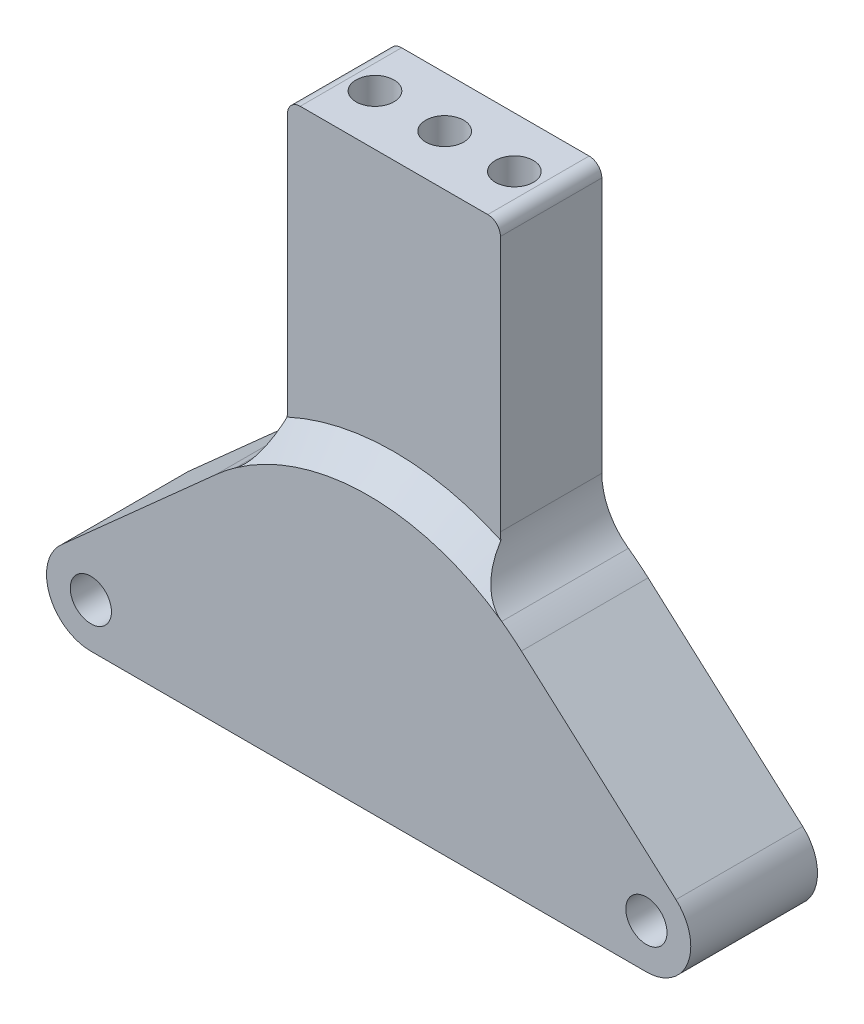
ISO-10303-21;
HEADER;
FILE_DESCRIPTION(('STEP AP214'),'2;1');
FILE_NAME('part.step','',(''),(''),'','','');
FILE_SCHEMA(('AUTOMOTIVE_DESIGN { 1 0 10303 214 1 1 1 1 }'));
ENDSEC;
DATA;
#1=APPLICATION_CONTEXT('core data for automotive mechanical design processes');
#2=APPLICATION_PROTOCOL_DEFINITION('international standard','automotive_design',2000,#1);
#3=PRODUCT_CONTEXT('',#1,'mechanical');
#4=PRODUCT('Part','Part','',(#3));
#5=PRODUCT_RELATED_PRODUCT_CATEGORY('part','',(#4));
#6=PRODUCT_DEFINITION_FORMATION('','',#4);
#7=PRODUCT_DEFINITION_CONTEXT('part definition',#1,'design');
#8=PRODUCT_DEFINITION('design','',#6,#7);
#9=PRODUCT_DEFINITION_SHAPE('','',#8);
#10=(LENGTH_UNIT() NAMED_UNIT(*) SI_UNIT(.MILLI.,.METRE.));
#11=(NAMED_UNIT(*) PLANE_ANGLE_UNIT() SI_UNIT($,.RADIAN.));
#12=(NAMED_UNIT(*) SI_UNIT($,.STERADIAN.) SOLID_ANGLE_UNIT());
#13=UNCERTAINTY_MEASURE_WITH_UNIT(LENGTH_MEASURE(1.E-05),#10,'distance_accuracy_value','');
#14=(GEOMETRIC_REPRESENTATION_CONTEXT(3) GLOBAL_UNCERTAINTY_ASSIGNED_CONTEXT((#13)) GLOBAL_UNIT_ASSIGNED_CONTEXT((#10,
#11,#12)) REPRESENTATION_CONTEXT('',''));
#15=CARTESIAN_POINT('',(0.,0.,0.));
#16=DIRECTION('',(0.,0.,1.));
#17=DIRECTION('',(1.,0.,0.));
#18=AXIS2_PLACEMENT_3D('',#15,#16,#17);
#19=CARTESIAN_POINT('',(0.,0.,10.));
#20=DIRECTION('',(0.,0.,-1.));
#21=DIRECTION('',(-1.,0.,0.));
#22=AXIS2_PLACEMENT_3D('',#19,#20,#21);
#23=CYLINDRICAL_SURFACE('',#22,18.1);
#24=CARTESIAN_POINT('',(0.,0.,10.));
#25=DIRECTION('',(0.,0.,1.));
#26=DIRECTION('',(1.,0.,0.));
#27=AXIS2_PLACEMENT_3D('',#24,#25,#26);
#28=CIRCLE('',#27,18.1);
#29=CARTESIAN_POINT('',(-10.4995670995671,14.7434422955322,10.));
#30=VERTEX_POINT('',#29);
#31=CARTESIAN_POINT('',(-12.0556569343066,13.5007827877611,10.));
#32=VERTEX_POINT('',#31);
#33=EDGE_CURVE('E146',#30,#32,#28,.T.);
#34=ORIENTED_EDGE('',*,*,#33,.F.);
#35=DIRECTION('',(0.,0.,-1.));
#36=VECTOR('',#35,1.);
#37=CARTESIAN_POINT('',(-10.4995670995671,14.7434422955322,10.));
#38=LINE('',#37,#36);
#39=CARTESIAN_POINT('',(-10.4995670995671,14.7434422955322,0.));
#40=VERTEX_POINT('',#39);
#41=EDGE_CURVE('E222',#30,#40,#38,.T.);
#42=ORIENTED_EDGE('',*,*,#41,.T.);
#43=CARTESIAN_POINT('',(0.,0.,0.));
#44=DIRECTION('',(0.,0.,1.));
#45=DIRECTION('',(1.,0.,0.));
#46=AXIS2_PLACEMENT_3D('',#43,#44,#45);
#47=CIRCLE('',#46,18.1);
#48=CARTESIAN_POINT('',(-12.0556569343066,13.5007827877611,0.));
#49=VERTEX_POINT('',#48);
#50=EDGE_CURVE('E163',#40,#49,#47,.T.);
#51=ORIENTED_EDGE('',*,*,#50,.T.);
#52=DIRECTION('',(0.,0.,-1.));
#53=VECTOR('',#52,1.);
#54=CARTESIAN_POINT('',(-12.0556569343066,13.5007827877611,10.));
#55=LINE('',#54,#53);
#56=EDGE_CURVE('E161',#32,#49,#55,.T.);
#57=ORIENTED_EDGE('',*,*,#56,.F.);
#58=EDGE_LOOP('',(#34,#42,#51,#57));
#59=FACE_BOUND('',#58,.T.);
#60=ADVANCED_FACE('F36',(#59),#23,.T.);
#61=DIRECTION('',(0.,0.,-1.));
#62=VECTOR('',#61,1.);
#63=CARTESIAN_POINT('',(10.4995670995671,14.7434422955322,10.));
#64=LINE('',#63,#62);
#65=CARTESIAN_POINT('',(10.4995670995671,14.7434422955322,0.));
#66=VERTEX_POINT('',#65);
#67=CARTESIAN_POINT('',(10.4995670995671,14.7434422955322,10.));
#68=VERTEX_POINT('',#67);
#69=EDGE_CURVE('E224',#66,#68,#64,.F.);
#70=ORIENTED_EDGE('',*,*,#69,.T.);
#71=CARTESIAN_POINT('',(12.0556569343066,13.5007827877611,10.));
#72=VERTEX_POINT('',#71);
#73=EDGE_CURVE('E159',#72,#68,#28,.T.);
#74=ORIENTED_EDGE('',*,*,#73,.F.);
#75=DIRECTION('',(0.,0.,-1.));
#76=VECTOR('',#75,1.);
#77=CARTESIAN_POINT('',(12.0556569343066,13.5007827877611,10.));
#78=LINE('',#77,#76);
#79=CARTESIAN_POINT('',(12.0556569343066,13.5007827877611,0.));
#80=VERTEX_POINT('',#79);
#81=EDGE_CURVE('E189',#72,#80,#78,.T.);
#82=ORIENTED_EDGE('',*,*,#81,.T.);
#83=EDGE_CURVE('E190',#80,#66,#47,.T.);
#84=ORIENTED_EDGE('',*,*,#83,.T.);
#85=EDGE_LOOP('',(#70,#74,#82,#84));
#86=FACE_BOUND('',#85,.T.);
#87=ADVANCED_FACE('F276',(#86),#23,.T.);
#88=CARTESIAN_POINT('',(-12.0556569343066,13.5007827877611,10.));
#89=DIRECTION('',(-0.666058394160585,0.745899601533761,0.));
#90=DIRECTION('',(-0.745899601533761,-0.666058394160585,0.));
#91=AXIS2_PLACEMENT_3D('',#88,#89,#90);
#92=PLANE('',#91);
#93=DIRECTION('',(0.745899601533761,0.666058394160585,0.));
#94=VECTOR('',#93,1.);
#95=CARTESIAN_POINT('',(-12.0556569343066,13.5007827877611,0.));
#96=LINE('',#95,#94);
#97=CARTESIAN_POINT('',(-24.251204379562,2.61064860536815,0.));
#98=VERTEX_POINT('',#97);
#99=EDGE_CURVE('E193',#98,#49,#96,.T.);
#100=ORIENTED_EDGE('',*,*,#99,.F.);
#101=DIRECTION('',(0.,0.,-1.));
#102=VECTOR('',#101,1.);
#103=CARTESIAN_POINT('',(-24.251204379562,2.61064860536815,10.));
#104=LINE('',#103,#102);
#105=CARTESIAN_POINT('',(-24.251204379562,2.61064860536815,10.));
#106=VERTEX_POINT('',#105);
#107=EDGE_CURVE('E168',#106,#98,#104,.T.);
#108=ORIENTED_EDGE('',*,*,#107,.F.);
#109=DIRECTION('',(0.745899601533761,0.666058394160585,0.));
#110=VECTOR('',#109,1.);
#111=CARTESIAN_POINT('',(-12.0556569343066,13.5007827877611,10.));
#112=LINE('',#111,#110);
#113=EDGE_CURVE('E152',#106,#32,#112,.T.);
#114=ORIENTED_EDGE('',*,*,#113,.T.);
#115=ORIENTED_EDGE('',*,*,#56,.T.);
#116=EDGE_LOOP('',(#100,#108,#114,#115));
#117=FACE_BOUND('',#116,.T.);
#118=ADVANCED_FACE('F170',(#117),#92,.T.);
#119=CARTESIAN_POINT('',(-21.92,0.,10.));
#120=DIRECTION('',(0.,0.,-1.));
#121=DIRECTION('',(-1.,0.,0.));
#122=AXIS2_PLACEMENT_3D('',#119,#120,#121);
#123=CYLINDRICAL_SURFACE('',#122,3.49999999999998);
#124=CARTESIAN_POINT('',(-21.92,0.,0.));
#125=DIRECTION('',(0.,0.,1.));
#126=DIRECTION('',(1.,0.,0.));
#127=AXIS2_PLACEMENT_3D('',#124,#125,#126);
#128=CIRCLE('',#127,3.49999999999998);
#129=CARTESIAN_POINT('',(-21.92,-3.49999999999998,0.));
#130=VERTEX_POINT('',#129);
#131=EDGE_CURVE('E195',#98,#130,#128,.T.);
#132=ORIENTED_EDGE('',*,*,#131,.T.);
#133=DIRECTION('',(0.,0.,-1.));
#134=VECTOR('',#133,1.);
#135=CARTESIAN_POINT('',(-21.92,-3.49999999999998,10.));
#136=LINE('',#135,#134);
#137=CARTESIAN_POINT('',(-21.92,-3.49999999999998,10.));
#138=VERTEX_POINT('',#137);
#139=EDGE_CURVE('E216',#138,#130,#136,.T.);
#140=ORIENTED_EDGE('',*,*,#139,.F.);
#141=CARTESIAN_POINT('',(-21.92,0.,10.));
#142=DIRECTION('',(0.,0.,1.));
#143=DIRECTION('',(1.,0.,0.));
#144=AXIS2_PLACEMENT_3D('',#141,#142,#143);
#145=CIRCLE('',#144,3.49999999999998);
#146=EDGE_CURVE('E172',#106,#138,#145,.T.);
#147=ORIENTED_EDGE('',*,*,#146,.F.);
#148=ORIENTED_EDGE('',*,*,#107,.T.);
#149=EDGE_LOOP('',(#132,#140,#147,#148));
#150=FACE_BOUND('',#149,.T.);
#151=ADVANCED_FACE('F411',(#150),#123,.T.);
#152=CARTESIAN_POINT('',(0.,-3.49999999999998,10.));
#153=DIRECTION('',(0.,1.,0.));
#154=DIRECTION('',(-1.,0.,0.));
#155=AXIS2_PLACEMENT_3D('',#152,#153,#154);
#156=PLANE('',#155);
#157=DIRECTION('',(1.,0.,0.));
#158=VECTOR('',#157,1.);
#159=CARTESIAN_POINT('',(0.,-3.49999999999998,0.));
#160=LINE('',#159,#158);
#161=CARTESIAN_POINT('',(21.92,-3.49999999999998,0.));
#162=VERTEX_POINT('',#161);
#163=EDGE_CURVE('E197',#130,#162,#160,.T.);
#164=ORIENTED_EDGE('',*,*,#163,.T.);
#165=DIRECTION('',(0.,0.,-1.));
#166=VECTOR('',#165,1.);
#167=CARTESIAN_POINT('',(21.92,-3.49999999999998,10.));
#168=LINE('',#167,#166);
#169=CARTESIAN_POINT('',(21.92,-3.49999999999998,10.));
#170=VERTEX_POINT('',#169);
#171=EDGE_CURVE('E213',#170,#162,#168,.T.);
#172=ORIENTED_EDGE('',*,*,#171,.F.);
#173=DIRECTION('',(1.,0.,0.));
#174=VECTOR('',#173,1.);
#175=CARTESIAN_POINT('',(0.,-3.49999999999998,10.));
#176=LINE('',#175,#174);
#177=EDGE_CURVE('E174',#138,#170,#176,.T.);
#178=ORIENTED_EDGE('',*,*,#177,.F.);
#179=ORIENTED_EDGE('',*,*,#139,.T.);
#180=EDGE_LOOP('',(#164,#172,#178,#179));
#181=FACE_BOUND('',#180,.T.);
#182=ADVANCED_FACE('F408',(#181),#156,.F.);
#183=CARTESIAN_POINT('',(21.92,0.,10.));
#184=DIRECTION('',(0.,0.,-1.));
#185=DIRECTION('',(-1.,0.,0.));
#186=AXIS2_PLACEMENT_3D('',#183,#184,#185);
#187=CYLINDRICAL_SURFACE('',#186,3.49999999999998);
#188=CARTESIAN_POINT('',(21.92,0.,0.));
#189=DIRECTION('',(0.,0.,1.));
#190=DIRECTION('',(1.,0.,0.));
#191=AXIS2_PLACEMENT_3D('',#188,#189,#190);
#192=CIRCLE('',#191,3.49999999999998);
#193=CARTESIAN_POINT('',(24.251204379562,2.61064860536815,0.));
#194=VERTEX_POINT('',#193);
#195=EDGE_CURVE('E199',#162,#194,#192,.T.);
#196=ORIENTED_EDGE('',*,*,#195,.T.);
#197=DIRECTION('',(0.,0.,-1.));
#198=VECTOR('',#197,1.);
#199=CARTESIAN_POINT('',(24.251204379562,2.61064860536815,10.));
#200=LINE('',#199,#198);
#201=CARTESIAN_POINT('',(24.251204379562,2.61064860536815,10.));
#202=VERTEX_POINT('',#201);
#203=EDGE_CURVE('E210',#202,#194,#200,.T.);
#204=ORIENTED_EDGE('',*,*,#203,.F.);
#205=CARTESIAN_POINT('',(21.92,0.,10.));
#206=DIRECTION('',(0.,0.,1.));
#207=DIRECTION('',(1.,0.,0.));
#208=AXIS2_PLACEMENT_3D('',#205,#206,#207);
#209=CIRCLE('',#208,3.49999999999998);
#210=EDGE_CURVE('E179',#170,#202,#209,.T.);
#211=ORIENTED_EDGE('',*,*,#210,.F.);
#212=ORIENTED_EDGE('',*,*,#171,.T.);
#213=EDGE_LOOP('',(#196,#204,#211,#212));
#214=FACE_BOUND('',#213,.T.);
#215=ADVANCED_FACE('F401',(#214),#187,.T.);
#216=CARTESIAN_POINT('',(21.92,0.,10.));
#217=DIRECTION('',(0.,0.,-1.));
#218=DIRECTION('',(-1.,0.,0.));
#219=AXIS2_PLACEMENT_3D('',#216,#217,#218);
#220=CYLINDRICAL_SURFACE('',#219,1.625);
#221=CARTESIAN_POINT('',(21.92,0.,10.));
#222=DIRECTION('',(0.,0.,1.));
#223=DIRECTION('',(1.,0.,0.));
#224=AXIS2_PLACEMENT_3D('',#221,#222,#223);
#225=CIRCLE('',#224,1.625);
#226=CARTESIAN_POINT('',(23.545,0.,10.));
#227=VERTEX_POINT('',#226);
#228=EDGE_CURVE('E183',#227,#227,#225,.T.);
#229=ORIENTED_EDGE('',*,*,#228,.T.);
#230=EDGE_LOOP('',(#229));
#231=FACE_BOUND('',#230,.T.);
#232=CARTESIAN_POINT('',(21.92,0.,0.));
#233=DIRECTION('',(0.,0.,1.));
#234=DIRECTION('',(1.,0.,0.));
#235=AXIS2_PLACEMENT_3D('',#232,#233,#234);
#236=CIRCLE('',#235,1.625);
#237=CARTESIAN_POINT('',(23.545,0.,0.));
#238=VERTEX_POINT('',#237);
#239=EDGE_CURVE('E203',#238,#238,#236,.T.);
#240=ORIENTED_EDGE('',*,*,#239,.F.);
#241=EDGE_LOOP('',(#240));
#242=FACE_BOUND('',#241,.T.);
#243=ADVANCED_FACE('F398',(#231,#242),#220,.F.);
#244=CARTESIAN_POINT('',(12.0556569343066,13.5007827877611,10.));
#245=DIRECTION('',(-0.666058394160585,-0.745899601533761,0.));
#246=DIRECTION('',(0.745899601533761,-0.666058394160585,0.));
#247=AXIS2_PLACEMENT_3D('',#244,#245,#246);
#248=PLANE('',#247);
#249=DIRECTION('',(-0.745899601533761,0.666058394160585,0.));
#250=VECTOR('',#249,1.);
#251=CARTESIAN_POINT('',(12.0556569343066,13.5007827877611,0.));
#252=LINE('',#251,#250);
#253=EDGE_CURVE('E201',#194,#80,#252,.T.);
#254=ORIENTED_EDGE('',*,*,#253,.T.);
#255=ORIENTED_EDGE('',*,*,#81,.F.);
#256=DIRECTION('',(-0.745899601533761,0.666058394160585,0.));
#257=VECTOR('',#256,1.);
#258=CARTESIAN_POINT('',(12.0556569343066,13.5007827877611,10.));
#259=LINE('',#258,#257);
#260=EDGE_CURVE('E181',#202,#72,#259,.T.);
#261=ORIENTED_EDGE('',*,*,#260,.F.);
#262=ORIENTED_EDGE('',*,*,#203,.T.);
#263=EDGE_LOOP('',(#254,#255,#261,#262));
#264=FACE_BOUND('',#263,.T.);
#265=ADVANCED_FACE('F396',(#264),#248,.F.);
#266=CARTESIAN_POINT('',(-21.92,0.,10.));
#267=DIRECTION('',(0.,0.,-1.));
#268=DIRECTION('',(-1.,0.,0.));
#269=AXIS2_PLACEMENT_3D('',#266,#267,#268);
#270=CYLINDRICAL_SURFACE('',#269,1.625);
#271=CARTESIAN_POINT('',(-21.92,0.,10.));
#272=DIRECTION('',(0.,0.,1.));
#273=DIRECTION('',(1.,0.,0.));
#274=AXIS2_PLACEMENT_3D('',#271,#272,#273);
#275=CIRCLE('',#274,1.625);
#276=CARTESIAN_POINT('',(-20.295,0.,10.));
#277=VERTEX_POINT('',#276);
#278=EDGE_CURVE('E186',#277,#277,#275,.F.);
#279=ORIENTED_EDGE('',*,*,#278,.F.);
#280=EDGE_LOOP('',(#279));
#281=FACE_BOUND('',#280,.T.);
#282=CARTESIAN_POINT('',(-21.92,0.,0.));
#283=DIRECTION('',(0.,0.,1.));
#284=DIRECTION('',(1.,0.,0.));
#285=AXIS2_PLACEMENT_3D('',#282,#283,#284);
#286=CIRCLE('',#285,1.625);
#287=CARTESIAN_POINT('',(-20.295,0.,0.));
#288=VERTEX_POINT('',#287);
#289=EDGE_CURVE('E157',#288,#288,#286,.F.);
#290=ORIENTED_EDGE('',*,*,#289,.T.);
#291=EDGE_LOOP('',(#290));
#292=FACE_BOUND('',#291,.T.);
#293=ADVANCED_FACE('F391',(#281,#292),#270,.F.);
#294=CARTESIAN_POINT('',(0.,0.,10.));
#295=DIRECTION('',(0.,0.,1.));
#296=DIRECTION('',(1.,0.,0.));
#297=AXIS2_PLACEMENT_3D('',#294,#295,#296);
#298=PLANE('',#297);
#299=ORIENTED_EDGE('',*,*,#73,.T.);
#300=EDGE_CURVE('E154',#68,#30,#28,.T.);
#301=ORIENTED_EDGE('',*,*,#300,.T.);
#302=ORIENTED_EDGE('',*,*,#33,.T.);
#303=ORIENTED_EDGE('',*,*,#113,.F.);
#304=ORIENTED_EDGE('',*,*,#146,.T.);
#305=ORIENTED_EDGE('',*,*,#177,.T.);
#306=ORIENTED_EDGE('',*,*,#210,.T.);
#307=ORIENTED_EDGE('',*,*,#260,.T.);
#308=EDGE_LOOP('',(#299,#301,#302,#303,#304,#305,#306,#307));
#309=FACE_BOUND('',#308,.T.);
#310=ORIENTED_EDGE('',*,*,#228,.F.);
#311=EDGE_LOOP('',(#310));
#312=FACE_BOUND('',#311,.T.);
#313=ORIENTED_EDGE('',*,*,#278,.T.);
#314=EDGE_LOOP('',(#313));
#315=FACE_BOUND('',#314,.T.);
#316=ADVANCED_FACE('F149',(#309,#312,#315),#298,.T.);
#317=CARTESIAN_POINT('',(0.,0.,0.));
#318=DIRECTION('',(0.,0.,1.));
#319=DIRECTION('',(1.,0.,0.));
#320=AXIS2_PLACEMENT_3D('',#317,#318,#319);
#321=PLANE('',#320);
#322=DIRECTION('',(1.,0.,0.));
#323=VECTOR('',#322,1.);
#324=CARTESIAN_POINT('',(0.,40.,0.));
#325=LINE('',#324,#323);
#326=CARTESIAN_POINT('',(-7.4,40.,0.));
#327=VERTEX_POINT('',#326);
#328=CARTESIAN_POINT('',(7.4,40.,0.));
#329=VERTEX_POINT('',#328);
#330=EDGE_CURVE('E331',#327,#329,#325,.T.);
#331=ORIENTED_EDGE('',*,*,#330,.T.);
#332=CARTESIAN_POINT('',(7.4,39.,0.));
#333=DIRECTION('',(0.,0.,1.));
#334=DIRECTION('',(1.,0.,0.));
#335=AXIS2_PLACEMENT_3D('',#332,#333,#334);
#336=CIRCLE('',#335,1.);
#337=CARTESIAN_POINT('',(8.4,39.,0.));
#338=VERTEX_POINT('',#337);
#339=EDGE_CURVE('E316',#329,#338,#336,.F.);
#340=ORIENTED_EDGE('',*,*,#339,.T.);
#341=DIRECTION('',(0.,-1.,0.));
#342=VECTOR('',#341,1.);
#343=CARTESIAN_POINT('',(8.40000000000001,0.,0.));
#344=LINE('',#343,#342);
#345=CARTESIAN_POINT('',(8.4,18.8162164103201,0.));
#346=VERTEX_POINT('',#345);
#347=EDGE_CURVE('E330',#338,#346,#344,.T.);
#348=ORIENTED_EDGE('',*,*,#347,.T.);
#349=CARTESIAN_POINT('',(13.4,18.8162164103201,0.));
#350=DIRECTION('',(0.,0.,1.));
#351=DIRECTION('',(1.,0.,0.));
#352=AXIS2_PLACEMENT_3D('',#349,#350,#351);
#353=CIRCLE('',#352,5.);
#354=EDGE_CURVE('E229',#346,#66,#353,.T.);
#355=ORIENTED_EDGE('',*,*,#354,.T.);
#356=ORIENTED_EDGE('',*,*,#83,.F.);
#357=ORIENTED_EDGE('',*,*,#253,.F.);
#358=ORIENTED_EDGE('',*,*,#195,.F.);
#359=ORIENTED_EDGE('',*,*,#163,.F.);
#360=ORIENTED_EDGE('',*,*,#131,.F.);
#361=ORIENTED_EDGE('',*,*,#99,.T.);
#362=ORIENTED_EDGE('',*,*,#50,.F.);
#363=CARTESIAN_POINT('',(-13.4,18.8162164103201,0.));
#364=DIRECTION('',(0.,0.,1.));
#365=DIRECTION('',(1.,0.,0.));
#366=AXIS2_PLACEMENT_3D('',#363,#364,#365);
#367=CIRCLE('',#366,5.);
#368=CARTESIAN_POINT('',(-8.4,18.8162164103201,0.));
#369=VERTEX_POINT('',#368);
#370=EDGE_CURVE('E234',#40,#369,#367,.T.);
#371=ORIENTED_EDGE('',*,*,#370,.T.);
#372=DIRECTION('',(0.,-1.,0.));
#373=VECTOR('',#372,1.);
#374=CARTESIAN_POINT('',(-8.4,0.,0.));
#375=LINE('',#374,#373);
#376=CARTESIAN_POINT('',(-8.4,39.,0.));
#377=VERTEX_POINT('',#376);
#378=EDGE_CURVE('E335',#377,#369,#375,.T.);
#379=ORIENTED_EDGE('',*,*,#378,.F.);
#380=CARTESIAN_POINT('',(-7.4,39.,0.));
#381=DIRECTION('',(0.,0.,1.));
#382=DIRECTION('',(1.,0.,0.));
#383=AXIS2_PLACEMENT_3D('',#380,#381,#382);
#384=CIRCLE('',#383,1.);
#385=EDGE_CURVE('E312',#377,#327,#384,.F.);
#386=ORIENTED_EDGE('',*,*,#385,.T.);
#387=EDGE_LOOP('',(#331,#340,#348,#355,#356,#357,#358,#359,#360,#361,#362,#371,#379,#386));
#388=FACE_BOUND('',#387,.T.);
#389=ORIENTED_EDGE('',*,*,#239,.T.);
#390=EDGE_LOOP('',(#389));
#391=FACE_BOUND('',#390,.T.);
#392=ORIENTED_EDGE('',*,*,#289,.F.);
#393=EDGE_LOOP('',(#392));
#394=FACE_BOUND('',#393,.T.);
#395=ADVANCED_FACE('F328',(#388,#391,#394),#321,.F.);
#396=CARTESIAN_POINT('',(8.40000000000001,0.,8.));
#397=DIRECTION('',(1.,0.,0.));
#398=DIRECTION('',(0.,1.,0.));
#399=AXIS2_PLACEMENT_3D('',#396,#397,#398);
#400=PLANE('',#399);
#401=ORIENTED_EDGE('',*,*,#347,.F.);
#402=DIRECTION('',(0.,0.,-1.));
#403=VECTOR('',#402,1.);
#404=CARTESIAN_POINT('',(8.4,39.,8.));
#405=LINE('',#404,#403);
#406=CARTESIAN_POINT('',(8.4,39.,8.));
#407=VERTEX_POINT('',#406);
#408=EDGE_CURVE('E59',#338,#407,#405,.F.);
#409=ORIENTED_EDGE('',*,*,#408,.T.);
#410=DIRECTION('',(0.,-1.,0.));
#411=VECTOR('',#410,1.);
#412=CARTESIAN_POINT('',(8.40000000000001,0.,8.));
#413=LINE('',#412,#411);
#414=CARTESIAN_POINT('',(8.4,18.8162164103201,8.));
#415=VERTEX_POINT('',#414);
#416=EDGE_CURVE('E321',#407,#415,#413,.T.);
#417=ORIENTED_EDGE('',*,*,#416,.T.);
#418=DIRECTION('',(0.,0.,-1.));
#419=VECTOR('',#418,1.);
#420=CARTESIAN_POINT('',(8.4,18.8162164103201,8.));
#421=LINE('',#420,#419);
#422=EDGE_CURVE('E167',#415,#346,#421,.T.);
#423=ORIENTED_EDGE('',*,*,#422,.T.);
#424=EDGE_LOOP('',(#401,#409,#417,#423));
#425=FACE_BOUND('',#424,.T.);
#426=ADVANCED_FACE('F332',(#425),#400,.T.);
#427=CARTESIAN_POINT('',(0.,40.,8.));
#428=DIRECTION('',(0.,1.,0.));
#429=DIRECTION('',(0.,0.,1.));
#430=AXIS2_PLACEMENT_3D('',#427,#428,#429);
#431=PLANE('',#430);
#432=CARTESIAN_POINT('',(-5.5,40.,4.));
#433=DIRECTION('',(0.,1.,0.));
#434=DIRECTION('',(0.,0.,1.));
#435=AXIS2_PLACEMENT_3D('',#432,#433,#434);
#436=CIRCLE('',#435,1.5);
#437=CARTESIAN_POINT('',(-5.5,40.,5.5));
#438=VERTEX_POINT('',#437);
#439=EDGE_CURVE('E338',#438,#438,#436,.T.);
#440=ORIENTED_EDGE('',*,*,#439,.F.);
#441=EDGE_LOOP('',(#440));
#442=FACE_BOUND('',#441,.T.);
#443=CARTESIAN_POINT('',(5.5,40.,4.));
#444=DIRECTION('',(0.,1.,0.));
#445=DIRECTION('',(0.,0.,1.));
#446=AXIS2_PLACEMENT_3D('',#443,#444,#445);
#447=CIRCLE('',#446,1.5);
#448=CARTESIAN_POINT('',(5.5,40.,5.5));
#449=VERTEX_POINT('',#448);
#450=EDGE_CURVE('E351',#449,#449,#447,.T.);
#451=ORIENTED_EDGE('',*,*,#450,.F.);
#452=EDGE_LOOP('',(#451));
#453=FACE_BOUND('',#452,.T.);
#454=CARTESIAN_POINT('',(0.,40.,4.));
#455=DIRECTION('',(0.,1.,0.));
#456=DIRECTION('',(0.,0.,1.));
#457=AXIS2_PLACEMENT_3D('',#454,#455,#456);
#458=CIRCLE('',#457,1.5);
#459=CARTESIAN_POINT('',(0.,40.,5.5));
#460=VERTEX_POINT('',#459);
#461=EDGE_CURVE('E345',#460,#460,#458,.T.);
#462=ORIENTED_EDGE('',*,*,#461,.F.);
#463=EDGE_LOOP('',(#462));
#464=FACE_BOUND('',#463,.T.);
#465=DIRECTION('',(1.,0.,0.));
#466=VECTOR('',#465,1.);
#467=CARTESIAN_POINT('',(0.,40.,8.));
#468=LINE('',#467,#466);
#469=CARTESIAN_POINT('',(-7.4,40.,8.));
#470=VERTEX_POINT('',#469);
#471=CARTESIAN_POINT('',(7.4,40.,8.));
#472=VERTEX_POINT('',#471);
#473=EDGE_CURVE('E320',#470,#472,#468,.T.);
#474=ORIENTED_EDGE('',*,*,#473,.T.);
#475=DIRECTION('',(0.,0.,-1.));
#476=VECTOR('',#475,1.);
#477=CARTESIAN_POINT('',(7.4,40.,8.));
#478=LINE('',#477,#476);
#479=EDGE_CURVE('E306',#472,#329,#478,.T.);
#480=ORIENTED_EDGE('',*,*,#479,.T.);
#481=ORIENTED_EDGE('',*,*,#330,.F.);
#482=DIRECTION('',(0.,0.,-1.));
#483=VECTOR('',#482,1.);
#484=CARTESIAN_POINT('',(-7.4,40.,8.));
#485=LINE('',#484,#483);
#486=EDGE_CURVE('E305',#327,#470,#485,.F.);
#487=ORIENTED_EDGE('',*,*,#486,.T.);
#488=EDGE_LOOP('',(#474,#480,#481,#487));
#489=FACE_BOUND('',#488,.T.);
#490=ADVANCED_FACE('F323',(#442,#453,#464,#489),#431,.T.);
#491=CARTESIAN_POINT('',(-8.4,0.,8.));
#492=DIRECTION('',(1.,0.,0.));
#493=DIRECTION('',(0.,1.,0.));
#494=AXIS2_PLACEMENT_3D('',#491,#492,#493);
#495=PLANE('',#494);
#496=DIRECTION('',(0.,-1.,0.));
#497=VECTOR('',#496,1.);
#498=CARTESIAN_POINT('',(-8.4,0.,8.));
#499=LINE('',#498,#497);
#500=CARTESIAN_POINT('',(-8.4,39.,8.));
#501=VERTEX_POINT('',#500);
#502=CARTESIAN_POINT('',(-8.4,18.8162164103201,8.));
#503=VERTEX_POINT('',#502);
#504=EDGE_CURVE('E325',#501,#503,#499,.T.);
#505=ORIENTED_EDGE('',*,*,#504,.F.);
#506=DIRECTION('',(0.,0.,-1.));
#507=VECTOR('',#506,1.);
#508=CARTESIAN_POINT('',(-8.4,39.,0.));
#509=LINE('',#508,#507);
#510=EDGE_CURVE('E11',#501,#377,#509,.T.);
#511=ORIENTED_EDGE('',*,*,#510,.T.);
#512=ORIENTED_EDGE('',*,*,#378,.T.);
#513=DIRECTION('',(0.,0.,1.));
#514=VECTOR('',#513,1.);
#515=CARTESIAN_POINT('',(-8.4,18.8162164103201,8.));
#516=LINE('',#515,#514);
#517=EDGE_CURVE('E226',#369,#503,#516,.T.);
#518=ORIENTED_EDGE('',*,*,#517,.T.);
#519=EDGE_LOOP('',(#505,#511,#512,#518));
#520=FACE_BOUND('',#519,.T.);
#521=ADVANCED_FACE('F363',(#520),#495,.F.);
#522=CARTESIAN_POINT('',(0.,0.,8.));
#523=DIRECTION('',(0.,0.,1.));
#524=DIRECTION('',(1.,0.,0.));
#525=AXIS2_PLACEMENT_3D('',#522,#523,#524);
#526=PLANE('',#525);
#527=ORIENTED_EDGE('',*,*,#416,.F.);
#528=CARTESIAN_POINT('',(7.4,39.,8.));
#529=DIRECTION('',(0.,0.,1.));
#530=DIRECTION('',(1.,0.,0.));
#531=AXIS2_PLACEMENT_3D('',#528,#529,#530);
#532=CIRCLE('',#531,1.);
#533=EDGE_CURVE('E44',#407,#472,#532,.T.);
#534=ORIENTED_EDGE('',*,*,#533,.T.);
#535=ORIENTED_EDGE('',*,*,#473,.F.);
#536=CARTESIAN_POINT('',(-7.4,39.,8.));
#537=DIRECTION('',(0.,0.,1.));
#538=DIRECTION('',(1.,0.,0.));
#539=AXIS2_PLACEMENT_3D('',#536,#537,#538);
#540=CIRCLE('',#539,1.);
#541=EDGE_CURVE('E51',#470,#501,#540,.T.);
#542=ORIENTED_EDGE('',*,*,#541,.T.);
#543=ORIENTED_EDGE('',*,*,#504,.T.);
#544=CARTESIAN_POINT('',(-13.4,18.8162164103201,8.));
#545=DIRECTION('',(0.,0.,1.));
#546=DIRECTION('',(1.,0.,0.));
#547=AXIS2_PLACEMENT_3D('',#544,#545,#546);
#548=CIRCLE('',#547,5.);
#549=CARTESIAN_POINT('',(-8.43267298154483,18.2455481251269,8.));
#550=VERTEX_POINT('',#549);
#551=EDGE_CURVE('E237',#503,#550,#548,.F.);
#552=ORIENTED_EDGE('',*,*,#551,.T.);
#553=CARTESIAN_POINT('',(0.,0.,8.));
#554=DIRECTION('',(0.,0.,1.));
#555=DIRECTION('',(1.,0.,0.));
#556=AXIS2_PLACEMENT_3D('',#553,#554,#555);
#557=CIRCLE('',#556,20.1);
#558=CARTESIAN_POINT('',(8.43267298154484,18.2455481251269,8.));
#559=VERTEX_POINT('',#558);
#560=EDGE_CURVE('E240',#550,#559,#557,.F.);
#561=ORIENTED_EDGE('',*,*,#560,.T.);
#562=CARTESIAN_POINT('',(13.4,18.8162164103201,8.));
#563=DIRECTION('',(0.,0.,1.));
#564=DIRECTION('',(1.,0.,0.));
#565=AXIS2_PLACEMENT_3D('',#562,#563,#564);
#566=CIRCLE('',#565,5.);
#567=EDGE_CURVE('E231',#559,#415,#566,.F.);
#568=ORIENTED_EDGE('',*,*,#567,.T.);
#569=EDGE_LOOP('',(#527,#534,#535,#542,#543,#552,#561,#568));
#570=FACE_BOUND('',#569,.T.);
#571=ADVANCED_FACE('F319',(#570),#526,.T.);
#572=CARTESIAN_POINT('',(0.,10.,4.));
#573=DIRECTION('',(0.,1.,0.));
#574=DIRECTION('',(0.,0.,1.));
#575=AXIS2_PLACEMENT_3D('',#572,#573,#574);
#576=CYLINDRICAL_SURFACE('',#575,1.5);
#577=CARTESIAN_POINT('',(0.,10.,4.));
#578=DIRECTION('',(0.,1.,0.));
#579=DIRECTION('',(0.,0.,1.));
#580=AXIS2_PLACEMENT_3D('',#577,#578,#579);
#581=CIRCLE('',#580,1.5);
#582=CARTESIAN_POINT('',(0.,10.,5.5));
#583=VERTEX_POINT('',#582);
#584=EDGE_CURVE('E348',#583,#583,#581,.T.);
#585=ORIENTED_EDGE('',*,*,#584,.F.);
#586=EDGE_LOOP('',(#585));
#587=FACE_BOUND('',#586,.T.);
#588=ORIENTED_EDGE('',*,*,#461,.T.);
#589=EDGE_LOOP('',(#588));
#590=FACE_BOUND('',#589,.T.);
#591=ADVANCED_FACE('F369',(#587,#590),#576,.F.);
#592=CARTESIAN_POINT('',(0.,10.,4.));
#593=DIRECTION('',(0.,1.,0.));
#594=DIRECTION('',(0.,0.,1.));
#595=AXIS2_PLACEMENT_3D('',#592,#593,#594);
#596=PLANE('',#595);
#597=ORIENTED_EDGE('',*,*,#584,.T.);
#598=EDGE_LOOP('',(#597));
#599=FACE_BOUND('',#598,.T.);
#600=ADVANCED_FACE('F371',(#599),#596,.T.);
#601=CARTESIAN_POINT('',(5.5,10.,4.));
#602=DIRECTION('',(0.,1.,0.));
#603=DIRECTION('',(0.,0.,1.));
#604=AXIS2_PLACEMENT_3D('',#601,#602,#603);
#605=CYLINDRICAL_SURFACE('',#604,1.5);
#606=CARTESIAN_POINT('',(5.5,10.,4.));
#607=DIRECTION('',(0.,1.,0.));
#608=DIRECTION('',(0.,0.,1.));
#609=AXIS2_PLACEMENT_3D('',#606,#607,#608);
#610=CIRCLE('',#609,1.5);
#611=CARTESIAN_POINT('',(5.5,10.,5.5));
#612=VERTEX_POINT('',#611);
#613=EDGE_CURVE('E354',#612,#612,#610,.T.);
#614=ORIENTED_EDGE('',*,*,#613,.F.);
#615=EDGE_LOOP('',(#614));
#616=FACE_BOUND('',#615,.T.);
#617=ORIENTED_EDGE('',*,*,#450,.T.);
#618=EDGE_LOOP('',(#617));
#619=FACE_BOUND('',#618,.T.);
#620=ADVANCED_FACE('F378',(#616,#619),#605,.F.);
#621=CARTESIAN_POINT('',(5.5,10.,4.));
#622=DIRECTION('',(0.,1.,0.));
#623=DIRECTION('',(0.,0.,1.));
#624=AXIS2_PLACEMENT_3D('',#621,#622,#623);
#625=PLANE('',#624);
#626=ORIENTED_EDGE('',*,*,#613,.T.);
#627=EDGE_LOOP('',(#626));
#628=FACE_BOUND('',#627,.T.);
#629=ADVANCED_FACE('F529',(#628),#625,.T.);
#630=CARTESIAN_POINT('',(-5.5,10.,4.));
#631=DIRECTION('',(0.,1.,0.));
#632=DIRECTION('',(0.,0.,1.));
#633=AXIS2_PLACEMENT_3D('',#630,#631,#632);
#634=CYLINDRICAL_SURFACE('',#633,1.5);
#635=CARTESIAN_POINT('',(-5.5,10.,4.));
#636=DIRECTION('',(0.,1.,0.));
#637=DIRECTION('',(0.,0.,1.));
#638=AXIS2_PLACEMENT_3D('',#635,#636,#637);
#639=CIRCLE('',#638,1.5);
#640=CARTESIAN_POINT('',(-5.5,10.,5.5));
#641=VERTEX_POINT('',#640);
#642=EDGE_CURVE('E333',#641,#641,#639,.T.);
#643=ORIENTED_EDGE('',*,*,#642,.F.);
#644=EDGE_LOOP('',(#643));
#645=FACE_BOUND('',#644,.T.);
#646=ORIENTED_EDGE('',*,*,#439,.T.);
#647=EDGE_LOOP('',(#646));
#648=FACE_BOUND('',#647,.T.);
#649=ADVANCED_FACE('F294',(#645,#648),#634,.F.);
#650=CARTESIAN_POINT('',(-5.5,10.,4.));
#651=DIRECTION('',(0.,1.,0.));
#652=DIRECTION('',(0.,0.,1.));
#653=AXIS2_PLACEMENT_3D('',#650,#651,#652);
#654=PLANE('',#653);
#655=ORIENTED_EDGE('',*,*,#642,.T.);
#656=EDGE_LOOP('',(#655));
#657=FACE_BOUND('',#656,.T.);
#658=ADVANCED_FACE('F287',(#657),#654,.T.);
#659=CARTESIAN_POINT('',(13.4,18.8162164103201,10.));
#660=DIRECTION('',(0.,0.,-1.));
#661=DIRECTION('',(-1.,0.,0.));
#662=AXIS2_PLACEMENT_3D('',#659,#660,#661);
#663=CYLINDRICAL_SURFACE('',#662,5.);
#664=ORIENTED_EDGE('',*,*,#567,.F.);
#665=CARTESIAN_POINT('',(8.43267298154484,18.2455481251269,8.));
#666=CARTESIAN_POINT('',(8.44736895646304,18.1178664763676,8.10971820748152));
#667=CARTESIAN_POINT('',(8.46710438898592,17.9892870212648,8.2178378147075));
#668=CARTESIAN_POINT('',(8.51753184681894,17.7303900194083,8.43000428014914));
#669=CARTESIAN_POINT('',(8.54825108641016,17.6000689364822,8.53404030362371));
#670=CARTESIAN_POINT('',(8.62197245554907,17.3365507678211,8.73802663482991));
#671=CARTESIAN_POINT('',(8.66514092552599,17.2033389882741,8.83789910567255));
#672=CARTESIAN_POINT('',(8.76454446656524,16.9366442385286,9.03022920044019));
#673=CARTESIAN_POINT('',(8.82076562090223,16.8031617062107,9.12269458153392));
#674=CARTESIAN_POINT('',(8.96626946028044,16.4970218667947,9.32443026341078));
#675=CARTESIAN_POINT('',(9.06041216852904,16.3245086820395,9.43053090941243));
#676=CARTESIAN_POINT('',(9.27445764856186,15.9842438128359,9.62080911986502));
#677=CARTESIAN_POINT('',(9.39425101206083,15.8164752287444,9.70507653736297));
#678=CARTESIAN_POINT('',(9.6382853737667,15.5177193008207,9.8333903785256));
#679=CARTESIAN_POINT('',(9.75838466812761,15.3852937154916,9.88181913888202));
#680=CARTESIAN_POINT('',(9.95127865525184,15.1948187603403,9.93677933946057));
#681=CARTESIAN_POINT('',(10.0176711787104,15.1327113264716,9.95214958341639));
#682=CARTESIAN_POINT('',(10.1543871271436,15.0117051396396,9.97668031768357));
#683=CARTESIAN_POINT('',(10.2247081507033,14.9528044690022,9.98584455760024));
#684=CARTESIAN_POINT('',(10.3298675320925,14.8695626234814,9.99452370082322));
#685=CARTESIAN_POINT('',(10.3633526272463,14.843740710252,9.99657690234528));
#686=CARTESIAN_POINT('',(10.4309756309865,14.7929490596947,9.99931465359398));
#687=CARTESIAN_POINT('',(10.4651129925865,14.7679786533593,10.0000003033153));
#688=CARTESIAN_POINT('',(10.4995670995671,14.7434422955322,10.));
#689=B_SPLINE_CURVE_WITH_KNOTS('',3,(#665,#666,#667,#668,#669,#670,#671,#672,#673,#674,#675,
#676,#677,#678,#679,#680,#681,#682,#683,#684,#685,#686,#687,#688),.UNSPECIFIED.,.F.,.F.,(4,2,2,
2,2,2,2,2,2,2,2,4),(0.,0.506991650045819,1.01524826459914,1.53063831334704,2.04548135832789,
2.71329269871157,3.37831041626009,3.93140516056167,4.20772742938047,4.48388259775064,
4.61085740692472,4.73773004224756),.UNSPECIFIED.);
#690=EDGE_CURVE('E250',#559,#68,#689,.T.);
#691=ORIENTED_EDGE('',*,*,#690,.T.);
#692=ORIENTED_EDGE('',*,*,#69,.F.);
#693=ORIENTED_EDGE('',*,*,#354,.F.);
#694=ORIENTED_EDGE('',*,*,#422,.F.);
#695=EDGE_LOOP('',(#664,#691,#692,#693,#694));
#696=FACE_BOUND('',#695,.T.);
#697=ADVANCED_FACE('F284',(#696),#663,.F.);
#698=CARTESIAN_POINT('',(-13.4,18.8162164103201,10.));
#699=DIRECTION('',(0.,0.,-1.));
#700=DIRECTION('',(-1.,0.,0.));
#701=AXIS2_PLACEMENT_3D('',#698,#699,#700);
#702=CYLINDRICAL_SURFACE('',#701,5.);
#703=ORIENTED_EDGE('',*,*,#551,.F.);
#704=ORIENTED_EDGE('',*,*,#517,.F.);
#705=ORIENTED_EDGE('',*,*,#370,.F.);
#706=ORIENTED_EDGE('',*,*,#41,.F.);
#707=CARTESIAN_POINT('',(-10.4995670995671,14.7434422955322,10.));
#708=CARTESIAN_POINT('',(-10.4132618735328,14.8048643770185,10.0000479664711));
#709=CARTESIAN_POINT('',(-10.3289751317291,14.8690608128841,9.9957054509683));
#710=CARTESIAN_POINT('',(-10.1652446516385,15.00211333915,9.978611818001));
#711=CARTESIAN_POINT('',(-10.0857945026281,15.0709629944935,9.96587210801584));
#712=CARTESIAN_POINT('',(-9.93327702377353,15.2117072330105,9.9325667649553));
#713=CARTESIAN_POINT('',(-9.86014162373137,15.2835522350764,9.91210224550846));
#714=CARTESIAN_POINT('',(-9.71953355824246,15.430288999832,9.86395338235925));
#715=CARTESIAN_POINT('',(-9.65206244089216,15.5051815872024,9.83626707331727));
#716=CARTESIAN_POINT('',(-9.45922603699127,15.732459940113,9.74375364048057));
#717=CARTESIAN_POINT('',(-9.34248684476901,15.8883366515786,9.66924883616345));
#718=CARTESIAN_POINT('',(-9.13174115144112,16.2050057904501,9.49995685368221));
#719=CARTESIAN_POINT('',(-9.03782885513946,16.365815604064,9.40508856899061));
#720=CARTESIAN_POINT('',(-8.88925984400651,16.6543564904509,9.22216557508839));
#721=CARTESIAN_POINT('',(-8.83050238188019,16.7818382833926,9.13696296224437));
#722=CARTESIAN_POINT('',(-8.7253106421642,17.0368028326288,8.95913884021341));
#723=CARTESIAN_POINT('',(-8.67888400002563,17.1642855408646,8.86651278029299));
#724=CARTESIAN_POINT('',(-8.5974902888246,17.4184664252497,8.6755017301089));
#725=CARTESIAN_POINT('',(-8.5625195892899,17.545164837436,8.57711857598254));
#726=CARTESIAN_POINT('',(-8.50320060969919,17.797334192919,8.37583002373857));
#727=CARTESIAN_POINT('',(-8.47884693868209,17.9228057274676,8.2729269499677));
#728=CARTESIAN_POINT('',(-8.45428849561289,18.0806474286563,8.14042939924398));
#729=CARTESIAN_POINT('',(-8.44948146637708,18.1137370234083,8.11248179520447));
#730=CARTESIAN_POINT('',(-8.44056244645503,18.1797520515352,8.05639365639072));
#731=CARTESIAN_POINT('',(-8.43644932967318,18.2126776650683,8.02825351283944));
#732=CARTESIAN_POINT('',(-8.43267298154483,18.245548125127,8.));
#733=B_SPLINE_CURVE_WITH_KNOTS('',3,(#707,#708,#709,#710,#711,#712,#713,#714,#715,#716,#717,
#718,#719,#720,#721,#722,#723,#724,#725,#726,#727,#728,#729,#730,#731,#732),.UNSPECIFIED.,.F.,
.F.,(4,2,2,2,2,2,2,2,2,2,2,2,4),(0.,0.317592021532464,0.634753485204939,0.947899856880364,
1.26113153735843,1.88368658731053,2.50876883734325,3.00072142877366,3.49297793904267,
3.98507829835754,4.47692849421272,4.60766113933384,4.73817954431675),.UNSPECIFIED.);
#734=EDGE_CURVE('E242',#30,#550,#733,.T.);
#735=ORIENTED_EDGE('',*,*,#734,.T.);
#736=EDGE_LOOP('',(#703,#704,#705,#706,#735));
#737=FACE_BOUND('',#736,.T.);
#738=ADVANCED_FACE('F257',(#737),#702,.F.);
#739=CARTESIAN_POINT('',(0.,0.,10.));
#740=DIRECTION('',(0.,0.,-1.));
#741=DIRECTION('',(-1.,0.,0.));
#742=AXIS2_PLACEMENT_3D('',#739,#740,#741);
#743=CONICAL_SURFACE('',#742,18.1,0.785398163397441);
#744=ORIENTED_EDGE('',*,*,#690,.F.);
#745=ORIENTED_EDGE('',*,*,#560,.F.);
#746=ORIENTED_EDGE('',*,*,#734,.F.);
#747=ORIENTED_EDGE('',*,*,#300,.F.);
#748=EDGE_LOOP('',(#744,#745,#746,#747));
#749=FACE_BOUND('',#748,.T.);
#750=ADVANCED_FACE('F260',(#749),#743,.T.);
#751=CARTESIAN_POINT('',(7.4,39.,8.));
#752=DIRECTION('',(0.,0.,-1.));
#753=DIRECTION('',(-1.,0.,0.));
#754=AXIS2_PLACEMENT_3D('',#751,#752,#753);
#755=CYLINDRICAL_SURFACE('',#754,1.);
#756=ORIENTED_EDGE('',*,*,#533,.F.);
#757=ORIENTED_EDGE('',*,*,#408,.F.);
#758=ORIENTED_EDGE('',*,*,#339,.F.);
#759=ORIENTED_EDGE('',*,*,#479,.F.);
#760=EDGE_LOOP('',(#756,#757,#758,#759));
#761=FACE_BOUND('',#760,.T.);
#762=ADVANCED_FACE('F265',(#761),#755,.T.);
#763=CARTESIAN_POINT('',(-7.4,39.,8.));
#764=DIRECTION('',(0.,0.,1.));
#765=DIRECTION('',(1.,0.,0.));
#766=AXIS2_PLACEMENT_3D('',#763,#764,#765);
#767=CYLINDRICAL_SURFACE('',#766,1.);
#768=ORIENTED_EDGE('',*,*,#541,.F.);
#769=ORIENTED_EDGE('',*,*,#486,.F.);
#770=ORIENTED_EDGE('',*,*,#385,.F.);
#771=ORIENTED_EDGE('',*,*,#510,.F.);
#772=EDGE_LOOP('',(#768,#769,#770,#771));
#773=FACE_BOUND('',#772,.T.);
#774=ADVANCED_FACE('F38',(#773),#767,.T.);
#775=CLOSED_SHELL('',(#60,#87,#118,#151,#182,#215,#243,#265,#293,#316,#395,#426,#490,#521,#571,
#591,#600,#620,#629,#649,#658,#697,#738,#750,#762,#774));
#776=MANIFOLD_SOLID_BREP('B2',#775);
#777=ADVANCED_BREP_SHAPE_REPRESENTATION('',(#18,#776),#14);
#778=SHAPE_DEFINITION_REPRESENTATION(#9,#777);
ENDSEC;
END-ISO-10303-21;
